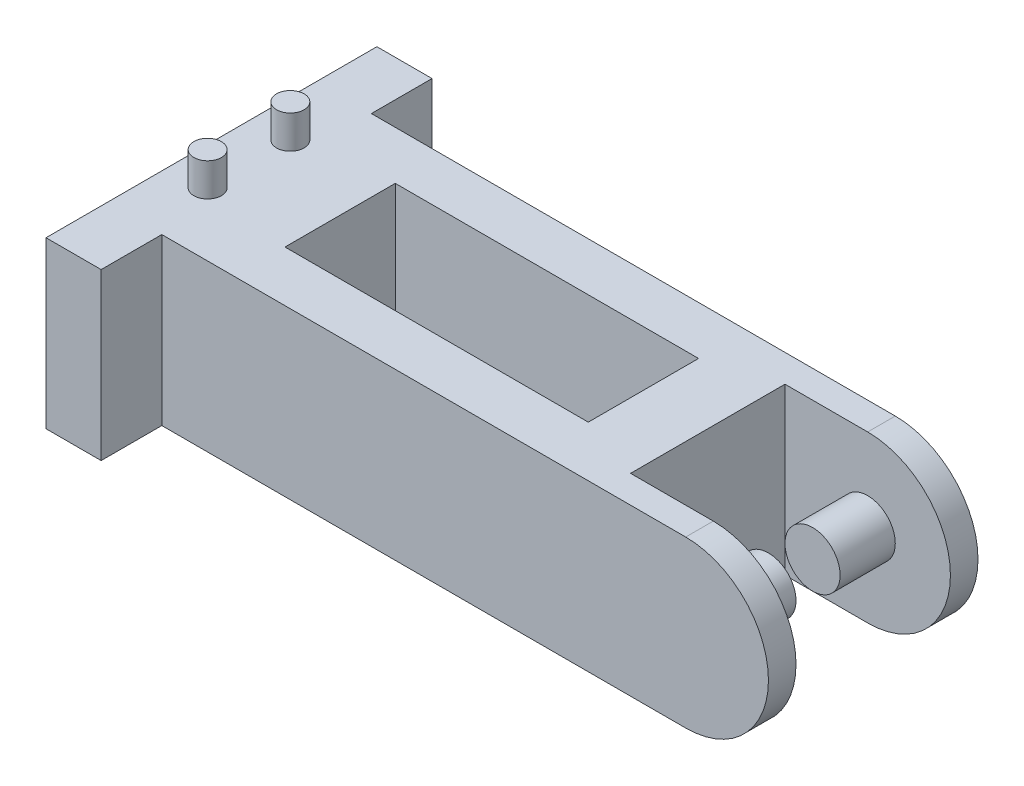
ISO-10303-21;
HEADER;
FILE_DESCRIPTION(('STEP AP214'),'2;1');
FILE_NAME('part.step','',(''),(''),'','','');
FILE_SCHEMA(('AUTOMOTIVE_DESIGN { 1 0 10303 214 1 1 1 1 }'));
ENDSEC;
DATA;
#1=APPLICATION_CONTEXT('core data for automotive mechanical design processes');
#2=APPLICATION_PROTOCOL_DEFINITION('international standard','automotive_design',2000,#1);
#3=PRODUCT_CONTEXT('',#1,'mechanical');
#4=PRODUCT('Part','Part','',(#3));
#5=PRODUCT_RELATED_PRODUCT_CATEGORY('part','',(#4));
#6=PRODUCT_DEFINITION_FORMATION('','',#4);
#7=PRODUCT_DEFINITION_CONTEXT('part definition',#1,'design');
#8=PRODUCT_DEFINITION('design','',#6,#7);
#9=PRODUCT_DEFINITION_SHAPE('','',#8);
#10=(LENGTH_UNIT() NAMED_UNIT(*) SI_UNIT(.MILLI.,.METRE.));
#11=(NAMED_UNIT(*) PLANE_ANGLE_UNIT() SI_UNIT($,.RADIAN.));
#12=(NAMED_UNIT(*) SI_UNIT($,.STERADIAN.) SOLID_ANGLE_UNIT());
#13=UNCERTAINTY_MEASURE_WITH_UNIT(LENGTH_MEASURE(1.E-05),#10,'distance_accuracy_value','');
#14=(GEOMETRIC_REPRESENTATION_CONTEXT(3) GLOBAL_UNCERTAINTY_ASSIGNED_CONTEXT((#13)) GLOBAL_UNIT_ASSIGNED_CONTEXT((#10,
#11,#12)) REPRESENTATION_CONTEXT('',''));
#15=CARTESIAN_POINT('',(0.,0.,0.));
#16=DIRECTION('',(0.,0.,1.));
#17=DIRECTION('',(1.,0.,0.));
#18=AXIS2_PLACEMENT_3D('',#15,#16,#17);
#19=CARTESIAN_POINT('',(-13.1249745176709,-15.,-19.));
#20=DIRECTION('',(0.,0.,-1.));
#21=DIRECTION('',(-1.,0.,0.));
#22=AXIS2_PLACEMENT_3D('',#19,#20,#21);
#23=PLANE('',#22);
#24=CARTESIAN_POINT('',(81.8750254823291,0.,-19.));
#25=DIRECTION('',(0.,0.,1.));
#26=DIRECTION('',(1.,0.,0.));
#27=AXIS2_PLACEMENT_3D('',#24,#25,#26);
#28=CIRCLE('',#27,15.);
#29=CARTESIAN_POINT('',(81.8750254823291,-15.,-19.));
#30=VERTEX_POINT('',#29);
#31=CARTESIAN_POINT('',(81.8750254823291,15.,-19.));
#32=VERTEX_POINT('',#31);
#33=EDGE_CURVE('E192',#30,#32,#28,.T.);
#34=ORIENTED_EDGE('',*,*,#33,.F.);
#35=DIRECTION('',(-1.,0.,0.));
#36=VECTOR('',#35,1.);
#37=CARTESIAN_POINT('',(-13.1249745176709,-15.,-19.));
#38=LINE('',#37,#36);
#39=CARTESIAN_POINT('',(-13.1249745176709,-15.,-19.));
#40=VERTEX_POINT('',#39);
#41=EDGE_CURVE('E231',#30,#40,#38,.T.);
#42=ORIENTED_EDGE('',*,*,#41,.T.);
#43=DIRECTION('',(0.,1.,0.));
#44=VECTOR('',#43,1.);
#45=CARTESIAN_POINT('',(-13.1249745176709,-15.,-19.));
#46=LINE('',#45,#44);
#47=CARTESIAN_POINT('',(-13.1249745176709,15.,-19.));
#48=VERTEX_POINT('',#47);
#49=EDGE_CURVE('E259',#40,#48,#46,.T.);
#50=ORIENTED_EDGE('',*,*,#49,.T.);
#51=DIRECTION('',(-1.,0.,0.));
#52=VECTOR('',#51,1.);
#53=CARTESIAN_POINT('',(-13.1249745176709,15.,-19.));
#54=LINE('',#53,#52);
#55=EDGE_CURVE('E203',#32,#48,#54,.T.);
#56=ORIENTED_EDGE('',*,*,#55,.F.);
#57=EDGE_LOOP('',(#34,#42,#50,#56));
#58=FACE_BOUND('',#57,.T.);
#59=ADVANCED_FACE('F41',(#58),#23,.T.);
#60=CARTESIAN_POINT('',(96.8750254823291,-15.,-14.));
#61=DIRECTION('',(0.,0.,1.));
#62=DIRECTION('',(1.,0.,0.));
#63=AXIS2_PLACEMENT_3D('',#60,#61,#62);
#64=PLANE('',#63);
#65=CARTESIAN_POINT('',(81.8750254823291,0.,-14.));
#66=DIRECTION('',(0.,0.,1.));
#67=DIRECTION('',(1.,0.,0.));
#68=AXIS2_PLACEMENT_3D('',#65,#66,#67);
#69=CIRCLE('',#68,5.);
#70=CARTESIAN_POINT('',(86.8750254823291,0.,-14.));
#71=VERTEX_POINT('',#70);
#72=EDGE_CURVE('E282',#71,#71,#69,.T.);
#73=ORIENTED_EDGE('',*,*,#72,.F.);
#74=EDGE_LOOP('',(#73));
#75=FACE_BOUND('',#74,.T.);
#76=DIRECTION('',(1.,0.,0.));
#77=VECTOR('',#76,1.);
#78=CARTESIAN_POINT('',(96.8750254823291,-15.,-14.));
#79=LINE('',#78,#77);
#80=CARTESIAN_POINT('',(66.8750254823291,-15.,-14.));
#81=VERTEX_POINT('',#80);
#82=CARTESIAN_POINT('',(81.8750254823291,-15.,-14.));
#83=VERTEX_POINT('',#82);
#84=EDGE_CURVE('E256',#81,#83,#79,.T.);
#85=ORIENTED_EDGE('',*,*,#84,.T.);
#86=CARTESIAN_POINT('',(81.8750254823291,0.,-14.));
#87=DIRECTION('',(0.,0.,1.));
#88=DIRECTION('',(1.,0.,0.));
#89=AXIS2_PLACEMENT_3D('',#86,#87,#88);
#90=CIRCLE('',#89,15.);
#91=CARTESIAN_POINT('',(81.8750254823291,15.,-14.));
#92=VERTEX_POINT('',#91);
#93=EDGE_CURVE('E200',#83,#92,#90,.T.);
#94=ORIENTED_EDGE('',*,*,#93,.T.);
#95=DIRECTION('',(1.,0.,0.));
#96=VECTOR('',#95,1.);
#97=CARTESIAN_POINT('',(96.8750254823291,15.,-14.));
#98=LINE('',#97,#96);
#99=CARTESIAN_POINT('',(66.8750254823291,15.,-14.));
#100=VERTEX_POINT('',#99);
#101=EDGE_CURVE('E228',#100,#92,#98,.T.);
#102=ORIENTED_EDGE('',*,*,#101,.F.);
#103=DIRECTION('',(0.,1.,0.));
#104=VECTOR('',#103,1.);
#105=CARTESIAN_POINT('',(66.8750254823291,-15.,-14.));
#106=LINE('',#105,#104);
#107=EDGE_CURVE('E260',#81,#100,#106,.T.);
#108=ORIENTED_EDGE('',*,*,#107,.F.);
#109=EDGE_LOOP('',(#85,#94,#102,#108));
#110=FACE_BOUND('',#109,.T.);
#111=ADVANCED_FACE('F307',(#75,#110),#64,.T.);
#112=CARTESIAN_POINT('',(96.8750254823291,-15.,14.));
#113=DIRECTION('',(0.,0.,-1.));
#114=DIRECTION('',(-1.,0.,0.));
#115=AXIS2_PLACEMENT_3D('',#112,#113,#114);
#116=PLANE('',#115);
#117=CARTESIAN_POINT('',(81.8750254823291,0.,14.));
#118=DIRECTION('',(0.,0.,-1.));
#119=DIRECTION('',(-1.,0.,0.));
#120=AXIS2_PLACEMENT_3D('',#117,#118,#119);
#121=CIRCLE('',#120,5.);
#122=CARTESIAN_POINT('',(76.8750254823291,0.,14.));
#123=VERTEX_POINT('',#122);
#124=EDGE_CURVE('E437',#123,#123,#121,.T.);
#125=ORIENTED_EDGE('',*,*,#124,.F.);
#126=EDGE_LOOP('',(#125));
#127=FACE_BOUND('',#126,.T.);
#128=CARTESIAN_POINT('',(81.8750254823291,0.,14.));
#129=DIRECTION('',(0.,0.,-1.));
#130=DIRECTION('',(-1.,0.,0.));
#131=AXIS2_PLACEMENT_3D('',#128,#129,#130);
#132=CIRCLE('',#131,15.);
#133=CARTESIAN_POINT('',(81.8750254823291,15.,14.));
#134=VERTEX_POINT('',#133);
#135=CARTESIAN_POINT('',(81.8750254823291,-15.,14.));
#136=VERTEX_POINT('',#135);
#137=EDGE_CURVE('E198',#134,#136,#132,.T.);
#138=ORIENTED_EDGE('',*,*,#137,.T.);
#139=DIRECTION('',(-1.,0.,0.));
#140=VECTOR('',#139,1.);
#141=CARTESIAN_POINT('',(96.8750254823291,-15.,14.));
#142=LINE('',#141,#140);
#143=CARTESIAN_POINT('',(66.8750254823291,-15.,14.));
#144=VERTEX_POINT('',#143);
#145=EDGE_CURVE('E251',#136,#144,#142,.T.);
#146=ORIENTED_EDGE('',*,*,#145,.T.);
#147=DIRECTION('',(0.,1.,0.));
#148=VECTOR('',#147,1.);
#149=CARTESIAN_POINT('',(66.8750254823291,-15.,14.));
#150=LINE('',#149,#148);
#151=CARTESIAN_POINT('',(66.8750254823291,15.,14.));
#152=VERTEX_POINT('',#151);
#153=EDGE_CURVE('E263',#144,#152,#150,.T.);
#154=ORIENTED_EDGE('',*,*,#153,.T.);
#155=DIRECTION('',(-1.,0.,0.));
#156=VECTOR('',#155,1.);
#157=CARTESIAN_POINT('',(96.8750254823291,15.,14.));
#158=LINE('',#157,#156);
#159=EDGE_CURVE('E223',#134,#152,#158,.T.);
#160=ORIENTED_EDGE('',*,*,#159,.F.);
#161=EDGE_LOOP('',(#138,#146,#154,#160));
#162=FACE_BOUND('',#161,.T.);
#163=ADVANCED_FACE('F312',(#127,#162),#116,.T.);
#164=CARTESIAN_POINT('',(-13.1249745176709,-15.,19.));
#165=DIRECTION('',(0.,0.,1.));
#166=DIRECTION('',(1.,0.,0.));
#167=AXIS2_PLACEMENT_3D('',#164,#165,#166);
#168=PLANE('',#167);
#169=DIRECTION('',(1.,0.,0.));
#170=VECTOR('',#169,1.);
#171=CARTESIAN_POINT('',(-13.1249745176709,-15.,19.));
#172=LINE('',#171,#170);
#173=CARTESIAN_POINT('',(-13.1249745176709,-15.,19.));
#174=VERTEX_POINT('',#173);
#175=CARTESIAN_POINT('',(81.8750254823291,-15.,19.));
#176=VERTEX_POINT('',#175);
#177=EDGE_CURVE('E248',#174,#176,#172,.T.);
#178=ORIENTED_EDGE('',*,*,#177,.T.);
#179=CARTESIAN_POINT('',(81.8750254823291,0.,19.));
#180=DIRECTION('',(0.,0.,1.));
#181=DIRECTION('',(1.,0.,0.));
#182=AXIS2_PLACEMENT_3D('',#179,#180,#181);
#183=CIRCLE('',#182,15.);
#184=CARTESIAN_POINT('',(81.8750254823291,15.,19.));
#185=VERTEX_POINT('',#184);
#186=EDGE_CURVE('E191',#176,#185,#183,.T.);
#187=ORIENTED_EDGE('',*,*,#186,.T.);
#188=DIRECTION('',(1.,0.,0.));
#189=VECTOR('',#188,1.);
#190=CARTESIAN_POINT('',(-13.1249745176709,15.,19.));
#191=LINE('',#190,#189);
#192=CARTESIAN_POINT('',(-13.1249745176709,15.,19.));
#193=VERTEX_POINT('',#192);
#194=EDGE_CURVE('E220',#193,#185,#191,.T.);
#195=ORIENTED_EDGE('',*,*,#194,.F.);
#196=DIRECTION('',(0.,1.,0.));
#197=VECTOR('',#196,1.);
#198=CARTESIAN_POINT('',(-13.1249745176709,-15.,19.));
#199=LINE('',#198,#197);
#200=EDGE_CURVE('E266',#174,#193,#199,.T.);
#201=ORIENTED_EDGE('',*,*,#200,.F.);
#202=EDGE_LOOP('',(#178,#187,#195,#201));
#203=FACE_BOUND('',#202,.T.);
#204=ADVANCED_FACE('F301',(#203),#168,.T.);
#205=CARTESIAN_POINT('',(0.,-15.,0.));
#206=DIRECTION('',(0.,-1.,0.));
#207=DIRECTION('',(0.,0.,-1.));
#208=AXIS2_PLACEMENT_3D('',#205,#206,#207);
#209=PLANE('',#208);
#210=DIRECTION('',(0.,0.,-1.));
#211=VECTOR('',#210,1.);
#212=CARTESIAN_POINT('',(0.,-15.,0.));
#213=LINE('',#212,#211);
#214=CARTESIAN_POINT('',(0.,-15.,9.79402466344234));
#215=VERTEX_POINT('',#214);
#216=CARTESIAN_POINT('',(0.,-15.,-10.2059753365577));
#217=VERTEX_POINT('',#216);
#218=EDGE_CURVE('E186',#215,#217,#213,.T.);
#219=ORIENTED_EDGE('',*,*,#218,.F.);
#220=DIRECTION('',(-1.,0.,0.));
#221=VECTOR('',#220,1.);
#222=CARTESIAN_POINT('',(0.,-15.,9.79402466344234));
#223=LINE('',#222,#221);
#224=CARTESIAN_POINT('',(55.,-15.,9.79402466344234));
#225=VERTEX_POINT('',#224);
#226=EDGE_CURVE('E179',#225,#215,#223,.T.);
#227=ORIENTED_EDGE('',*,*,#226,.F.);
#228=DIRECTION('',(0.,0.,1.));
#229=VECTOR('',#228,1.);
#230=CARTESIAN_POINT('',(55.,-15.,0.));
#231=LINE('',#230,#229);
#232=CARTESIAN_POINT('',(55.,-15.,-10.2059753365577));
#233=VERTEX_POINT('',#232);
#234=EDGE_CURVE('E159',#233,#225,#231,.T.);
#235=ORIENTED_EDGE('',*,*,#234,.F.);
#236=DIRECTION('',(1.,0.,0.));
#237=VECTOR('',#236,1.);
#238=CARTESIAN_POINT('',(0.,-15.,-10.2059753365577));
#239=LINE('',#238,#237);
#240=EDGE_CURVE('E184',#217,#233,#239,.T.);
#241=ORIENTED_EDGE('',*,*,#240,.F.);
#242=EDGE_LOOP('',(#219,#227,#235,#241));
#243=FACE_BOUND('',#242,.T.);
#244=ORIENTED_EDGE('',*,*,#41,.F.);
#245=DIRECTION('',(0.,0.,1.));
#246=VECTOR('',#245,1.);
#247=CARTESIAN_POINT('',(81.8750254823291,-15.,-19.));
#248=LINE('',#247,#246);
#249=EDGE_CURVE('E188',#30,#83,#248,.T.);
#250=ORIENTED_EDGE('',*,*,#249,.T.);
#251=ORIENTED_EDGE('',*,*,#84,.F.);
#252=DIRECTION('',(0.,0.,-1.));
#253=VECTOR('',#252,1.);
#254=CARTESIAN_POINT('',(66.8750254823291,-15.,-14.));
#255=LINE('',#254,#253);
#256=EDGE_CURVE('E253',#144,#81,#255,.T.);
#257=ORIENTED_EDGE('',*,*,#256,.F.);
#258=ORIENTED_EDGE('',*,*,#145,.F.);
#259=DIRECTION('',(0.,0.,1.));
#260=VECTOR('',#259,1.);
#261=CARTESIAN_POINT('',(81.8750254823291,-15.,-19.));
#262=LINE('',#261,#260);
#263=EDGE_CURVE('E279',#136,#176,#262,.T.);
#264=ORIENTED_EDGE('',*,*,#263,.T.);
#265=ORIENTED_EDGE('',*,*,#177,.F.);
#266=DIRECTION('',(0.,0.,-1.));
#267=VECTOR('',#266,1.);
#268=CARTESIAN_POINT('',(-13.1249745176709,-15.,30.));
#269=LINE('',#268,#267);
#270=CARTESIAN_POINT('',(-13.1249745176709,-15.,30.));
#271=VERTEX_POINT('',#270);
#272=EDGE_CURVE('E245',#271,#174,#269,.T.);
#273=ORIENTED_EDGE('',*,*,#272,.F.);
#274=DIRECTION('',(1.,0.,0.));
#275=VECTOR('',#274,1.);
#276=CARTESIAN_POINT('',(-23.1249745176709,-15.,30.));
#277=LINE('',#276,#275);
#278=CARTESIAN_POINT('',(-23.1249745176709,-15.,30.));
#279=VERTEX_POINT('',#278);
#280=EDGE_CURVE('E242',#279,#271,#277,.T.);
#281=ORIENTED_EDGE('',*,*,#280,.F.);
#282=DIRECTION('',(0.,0.,1.));
#283=VECTOR('',#282,1.);
#284=CARTESIAN_POINT('',(-23.1249745176709,-15.,-30.));
#285=LINE('',#284,#283);
#286=CARTESIAN_POINT('',(-23.1249745176709,-15.,-30.));
#287=VERTEX_POINT('',#286);
#288=EDGE_CURVE('E239',#287,#279,#285,.T.);
#289=ORIENTED_EDGE('',*,*,#288,.F.);
#290=DIRECTION('',(-1.,0.,0.));
#291=VECTOR('',#290,1.);
#292=CARTESIAN_POINT('',(-23.1249745176709,-15.,-30.));
#293=LINE('',#292,#291);
#294=CARTESIAN_POINT('',(-13.1249745176709,-15.,-30.));
#295=VERTEX_POINT('',#294);
#296=EDGE_CURVE('E236',#295,#287,#293,.T.);
#297=ORIENTED_EDGE('',*,*,#296,.F.);
#298=DIRECTION('',(0.,0.,-1.));
#299=VECTOR('',#298,1.);
#300=CARTESIAN_POINT('',(-13.1249745176709,-15.,-30.));
#301=LINE('',#300,#299);
#302=EDGE_CURVE('E233',#40,#295,#301,.T.);
#303=ORIENTED_EDGE('',*,*,#302,.F.);
#304=EDGE_LOOP('',(#244,#250,#251,#257,#258,#264,#265,#273,#281,#289,#297,#303));
#305=FACE_BOUND('',#304,.T.);
#306=ADVANCED_FACE('F291',(#243,#305),#209,.T.);
#307=CARTESIAN_POINT('',(0.,15.,0.));
#308=DIRECTION('',(0.,-1.,0.));
#309=DIRECTION('',(0.,0.,-1.));
#310=AXIS2_PLACEMENT_3D('',#307,#308,#309);
#311=PLANE('',#310);
#312=CARTESIAN_POINT('',(-16.3207922027181,15.,7.5));
#313=DIRECTION('',(0.,-1.,0.));
#314=DIRECTION('',(0.,0.,-1.));
#315=AXIS2_PLACEMENT_3D('',#312,#313,#314);
#316=CIRCLE('',#315,2.5);
#317=CARTESIAN_POINT('',(-16.3207922027181,15.,5.));
#318=VERTEX_POINT('',#317);
#319=EDGE_CURVE('E11',#318,#318,#316,.F.);
#320=ORIENTED_EDGE('',*,*,#319,.F.);
#321=EDGE_LOOP('',(#320));
#322=FACE_BOUND('',#321,.T.);
#323=CARTESIAN_POINT('',(-16.3207922027181,15.,-7.5));
#324=DIRECTION('',(0.,-1.,0.));
#325=DIRECTION('',(0.,0.,-1.));
#326=AXIS2_PLACEMENT_3D('',#323,#324,#325);
#327=CIRCLE('',#326,2.5);
#328=CARTESIAN_POINT('',(-16.3207922027181,15.,-10.));
#329=VERTEX_POINT('',#328);
#330=EDGE_CURVE('E48',#329,#329,#327,.F.);
#331=ORIENTED_EDGE('',*,*,#330,.F.);
#332=EDGE_LOOP('',(#331));
#333=FACE_BOUND('',#332,.T.);
#334=DIRECTION('',(1.,0.,0.));
#335=VECTOR('',#334,1.);
#336=CARTESIAN_POINT('',(0.,15.,9.79402466344234));
#337=LINE('',#336,#335);
#338=CARTESIAN_POINT('',(0.,15.,9.79402466344234));
#339=VERTEX_POINT('',#338);
#340=CARTESIAN_POINT('',(55.,15.,9.79402466344234));
#341=VERTEX_POINT('',#340);
#342=EDGE_CURVE('E165',#339,#341,#337,.T.);
#343=ORIENTED_EDGE('',*,*,#342,.F.);
#344=DIRECTION('',(0.,0.,1.));
#345=VECTOR('',#344,1.);
#346=CARTESIAN_POINT('',(0.,15.,-10.2059753365577));
#347=LINE('',#346,#345);
#348=CARTESIAN_POINT('',(0.,15.,-10.2059753365577));
#349=VERTEX_POINT('',#348);
#350=EDGE_CURVE('E63',#349,#339,#347,.T.);
#351=ORIENTED_EDGE('',*,*,#350,.F.);
#352=DIRECTION('',(-1.,0.,0.));
#353=VECTOR('',#352,1.);
#354=CARTESIAN_POINT('',(0.,15.,-10.2059753365577));
#355=LINE('',#354,#353);
#356=CARTESIAN_POINT('',(55.,15.,-10.2059753365577));
#357=VERTEX_POINT('',#356);
#358=EDGE_CURVE('E172',#357,#349,#355,.T.);
#359=ORIENTED_EDGE('',*,*,#358,.F.);
#360=DIRECTION('',(0.,0.,-1.));
#361=VECTOR('',#360,1.);
#362=CARTESIAN_POINT('',(55.,15.,-10.2059753365577));
#363=LINE('',#362,#361);
#364=EDGE_CURVE('E156',#341,#357,#363,.T.);
#365=ORIENTED_EDGE('',*,*,#364,.F.);
#366=EDGE_LOOP('',(#343,#351,#359,#365));
#367=FACE_BOUND('',#366,.T.);
#368=DIRECTION('',(0.,0.,1.));
#369=VECTOR('',#368,1.);
#370=CARTESIAN_POINT('',(81.8750254823291,15.,-19.));
#371=LINE('',#370,#369);
#372=EDGE_CURVE('E194',#32,#92,#371,.T.);
#373=ORIENTED_EDGE('',*,*,#372,.F.);
#374=ORIENTED_EDGE('',*,*,#55,.T.);
#375=DIRECTION('',(0.,0.,-1.));
#376=VECTOR('',#375,1.);
#377=CARTESIAN_POINT('',(-13.1249745176709,15.,-30.));
#378=LINE('',#377,#376);
#379=CARTESIAN_POINT('',(-13.1249745176709,15.,-30.));
#380=VERTEX_POINT('',#379);
#381=EDGE_CURVE('E205',#48,#380,#378,.T.);
#382=ORIENTED_EDGE('',*,*,#381,.T.);
#383=DIRECTION('',(-1.,0.,0.));
#384=VECTOR('',#383,1.);
#385=CARTESIAN_POINT('',(-23.1249745176709,15.,-30.));
#386=LINE('',#385,#384);
#387=CARTESIAN_POINT('',(-23.1249745176709,15.,-30.));
#388=VERTEX_POINT('',#387);
#389=EDGE_CURVE('E208',#380,#388,#386,.T.);
#390=ORIENTED_EDGE('',*,*,#389,.T.);
#391=DIRECTION('',(0.,0.,1.));
#392=VECTOR('',#391,1.);
#393=CARTESIAN_POINT('',(-23.1249745176709,15.,-30.));
#394=LINE('',#393,#392);
#395=CARTESIAN_POINT('',(-23.1249745176709,15.,30.));
#396=VERTEX_POINT('',#395);
#397=EDGE_CURVE('E211',#388,#396,#394,.T.);
#398=ORIENTED_EDGE('',*,*,#397,.T.);
#399=DIRECTION('',(1.,0.,0.));
#400=VECTOR('',#399,1.);
#401=CARTESIAN_POINT('',(-23.1249745176709,15.,30.));
#402=LINE('',#401,#400);
#403=CARTESIAN_POINT('',(-13.1249745176709,15.,30.));
#404=VERTEX_POINT('',#403);
#405=EDGE_CURVE('E214',#396,#404,#402,.T.);
#406=ORIENTED_EDGE('',*,*,#405,.T.);
#407=DIRECTION('',(0.,0.,-1.));
#408=VECTOR('',#407,1.);
#409=CARTESIAN_POINT('',(-13.1249745176709,15.,30.));
#410=LINE('',#409,#408);
#411=EDGE_CURVE('E217',#404,#193,#410,.T.);
#412=ORIENTED_EDGE('',*,*,#411,.T.);
#413=ORIENTED_EDGE('',*,*,#194,.T.);
#414=DIRECTION('',(0.,0.,1.));
#415=VECTOR('',#414,1.);
#416=CARTESIAN_POINT('',(81.8750254823291,15.,-19.));
#417=LINE('',#416,#415);
#418=EDGE_CURVE('E262',#134,#185,#417,.T.);
#419=ORIENTED_EDGE('',*,*,#418,.F.);
#420=ORIENTED_EDGE('',*,*,#159,.T.);
#421=DIRECTION('',(0.,0.,-1.));
#422=VECTOR('',#421,1.);
#423=CARTESIAN_POINT('',(66.8750254823291,15.,-14.));
#424=LINE('',#423,#422);
#425=EDGE_CURVE('E225',#152,#100,#424,.T.);
#426=ORIENTED_EDGE('',*,*,#425,.T.);
#427=ORIENTED_EDGE('',*,*,#101,.T.);
#428=EDGE_LOOP('',(#373,#374,#382,#390,#398,#406,#412,#413,#419,#420,#426,#427));
#429=FACE_BOUND('',#428,.T.);
#430=ADVANCED_FACE('F169',(#322,#333,#367,#429),#311,.F.);
#431=CARTESIAN_POINT('',(66.8750254823291,-15.,-14.));
#432=DIRECTION('',(1.,0.,0.));
#433=DIRECTION('',(0.,0.,-1.));
#434=AXIS2_PLACEMENT_3D('',#431,#432,#433);
#435=PLANE('',#434);
#436=ORIENTED_EDGE('',*,*,#107,.T.);
#437=ORIENTED_EDGE('',*,*,#425,.F.);
#438=ORIENTED_EDGE('',*,*,#153,.F.);
#439=ORIENTED_EDGE('',*,*,#256,.T.);
#440=EDGE_LOOP('',(#436,#437,#438,#439));
#441=FACE_BOUND('',#440,.T.);
#442=ADVANCED_FACE('F290',(#441),#435,.T.);
#443=CARTESIAN_POINT('',(-13.1249745176709,-15.,30.));
#444=DIRECTION('',(1.,0.,0.));
#445=DIRECTION('',(0.,0.,-1.));
#446=AXIS2_PLACEMENT_3D('',#443,#444,#445);
#447=PLANE('',#446);
#448=ORIENTED_EDGE('',*,*,#200,.T.);
#449=ORIENTED_EDGE('',*,*,#411,.F.);
#450=DIRECTION('',(0.,1.,0.));
#451=VECTOR('',#450,1.);
#452=CARTESIAN_POINT('',(-13.1249745176709,-15.,30.));
#453=LINE('',#452,#451);
#454=EDGE_CURVE('E268',#271,#404,#453,.T.);
#455=ORIENTED_EDGE('',*,*,#454,.F.);
#456=ORIENTED_EDGE('',*,*,#272,.T.);
#457=EDGE_LOOP('',(#448,#449,#455,#456));
#458=FACE_BOUND('',#457,.T.);
#459=ADVANCED_FACE('F298',(#458),#447,.T.);
#460=CARTESIAN_POINT('',(-23.1249745176709,-15.,30.));
#461=DIRECTION('',(0.,0.,1.));
#462=DIRECTION('',(1.,0.,0.));
#463=AXIS2_PLACEMENT_3D('',#460,#461,#462);
#464=PLANE('',#463);
#465=ORIENTED_EDGE('',*,*,#454,.T.);
#466=ORIENTED_EDGE('',*,*,#405,.F.);
#467=DIRECTION('',(0.,1.,0.));
#468=VECTOR('',#467,1.);
#469=CARTESIAN_POINT('',(-23.1249745176709,-15.,30.));
#470=LINE('',#469,#468);
#471=EDGE_CURVE('E270',#279,#396,#470,.T.);
#472=ORIENTED_EDGE('',*,*,#471,.F.);
#473=ORIENTED_EDGE('',*,*,#280,.T.);
#474=EDGE_LOOP('',(#465,#466,#472,#473));
#475=FACE_BOUND('',#474,.T.);
#476=ADVANCED_FACE('F340',(#475),#464,.T.);
#477=CARTESIAN_POINT('',(-23.1249745176709,-15.,-30.));
#478=DIRECTION('',(-1.,0.,0.));
#479=DIRECTION('',(0.,0.,1.));
#480=AXIS2_PLACEMENT_3D('',#477,#478,#479);
#481=PLANE('',#480);
#482=ORIENTED_EDGE('',*,*,#471,.T.);
#483=ORIENTED_EDGE('',*,*,#397,.F.);
#484=DIRECTION('',(0.,1.,0.));
#485=VECTOR('',#484,1.);
#486=CARTESIAN_POINT('',(-23.1249745176709,-15.,-30.));
#487=LINE('',#486,#485);
#488=EDGE_CURVE('E272',#287,#388,#487,.T.);
#489=ORIENTED_EDGE('',*,*,#488,.F.);
#490=ORIENTED_EDGE('',*,*,#288,.T.);
#491=EDGE_LOOP('',(#482,#483,#489,#490));
#492=FACE_BOUND('',#491,.T.);
#493=ADVANCED_FACE('F335',(#492),#481,.T.);
#494=CARTESIAN_POINT('',(-23.1249745176709,-15.,-30.));
#495=DIRECTION('',(0.,0.,-1.));
#496=DIRECTION('',(-1.,0.,0.));
#497=AXIS2_PLACEMENT_3D('',#494,#495,#496);
#498=PLANE('',#497);
#499=ORIENTED_EDGE('',*,*,#488,.T.);
#500=ORIENTED_EDGE('',*,*,#389,.F.);
#501=DIRECTION('',(0.,1.,0.));
#502=VECTOR('',#501,1.);
#503=CARTESIAN_POINT('',(-13.1249745176709,-15.,-30.));
#504=LINE('',#503,#502);
#505=EDGE_CURVE('E274',#295,#380,#504,.T.);
#506=ORIENTED_EDGE('',*,*,#505,.F.);
#507=ORIENTED_EDGE('',*,*,#296,.T.);
#508=EDGE_LOOP('',(#499,#500,#506,#507));
#509=FACE_BOUND('',#508,.T.);
#510=ADVANCED_FACE('F333',(#509),#498,.T.);
#511=CARTESIAN_POINT('',(-13.1249745176709,-15.,-30.));
#512=DIRECTION('',(1.,0.,0.));
#513=DIRECTION('',(0.,0.,-1.));
#514=AXIS2_PLACEMENT_3D('',#511,#512,#513);
#515=PLANE('',#514);
#516=ORIENTED_EDGE('',*,*,#505,.T.);
#517=ORIENTED_EDGE('',*,*,#381,.F.);
#518=ORIENTED_EDGE('',*,*,#49,.F.);
#519=ORIENTED_EDGE('',*,*,#302,.T.);
#520=EDGE_LOOP('',(#516,#517,#518,#519));
#521=FACE_BOUND('',#520,.T.);
#522=ADVANCED_FACE('F328',(#521),#515,.T.);
#523=CARTESIAN_POINT('',(81.8750254823291,0.,-19.));
#524=DIRECTION('',(0.,0.,1.));
#525=DIRECTION('',(1.,0.,0.));
#526=AXIS2_PLACEMENT_3D('',#523,#524,#525);
#527=CYLINDRICAL_SURFACE('',#526,15.);
#528=ORIENTED_EDGE('',*,*,#418,.T.);
#529=ORIENTED_EDGE('',*,*,#186,.F.);
#530=ORIENTED_EDGE('',*,*,#263,.F.);
#531=ORIENTED_EDGE('',*,*,#137,.F.);
#532=EDGE_LOOP('',(#528,#529,#530,#531));
#533=FACE_BOUND('',#532,.T.);
#534=ADVANCED_FACE('F350',(#533),#527,.T.);
#535=ORIENTED_EDGE('',*,*,#93,.F.);
#536=ORIENTED_EDGE('',*,*,#249,.F.);
#537=ORIENTED_EDGE('',*,*,#33,.T.);
#538=ORIENTED_EDGE('',*,*,#372,.T.);
#539=EDGE_LOOP('',(#535,#536,#537,#538));
#540=FACE_BOUND('',#539,.T.);
#541=ADVANCED_FACE('F321',(#540),#527,.T.);
#542=CARTESIAN_POINT('',(0.,-23.,-10.2059753365577));
#543=DIRECTION('',(-1.,0.,0.));
#544=DIRECTION('',(0.,0.,1.));
#545=AXIS2_PLACEMENT_3D('',#542,#543,#544);
#546=PLANE('',#545);
#547=ORIENTED_EDGE('',*,*,#218,.T.);
#548=DIRECTION('',(0.,1.,0.));
#549=VECTOR('',#548,1.);
#550=CARTESIAN_POINT('',(0.,-23.,-10.2059753365577));
#551=LINE('',#550,#549);
#552=EDGE_CURVE('E177',#217,#349,#551,.T.);
#553=ORIENTED_EDGE('',*,*,#552,.T.);
#554=ORIENTED_EDGE('',*,*,#350,.T.);
#555=DIRECTION('',(0.,1.,0.));
#556=VECTOR('',#555,1.);
#557=CARTESIAN_POINT('',(0.,-23.,9.79402466344234));
#558=LINE('',#557,#556);
#559=EDGE_CURVE('E162',#215,#339,#558,.T.);
#560=ORIENTED_EDGE('',*,*,#559,.F.);
#561=EDGE_LOOP('',(#547,#553,#554,#560));
#562=FACE_BOUND('',#561,.T.);
#563=ADVANCED_FACE('F381',(#562),#546,.F.);
#564=CARTESIAN_POINT('',(0.,-23.,-10.2059753365577));
#565=DIRECTION('',(0.,0.,-1.));
#566=DIRECTION('',(-1.,0.,0.));
#567=AXIS2_PLACEMENT_3D('',#564,#565,#566);
#568=PLANE('',#567);
#569=ORIENTED_EDGE('',*,*,#240,.T.);
#570=DIRECTION('',(0.,1.,0.));
#571=VECTOR('',#570,1.);
#572=CARTESIAN_POINT('',(55.,-23.,-10.2059753365577));
#573=LINE('',#572,#571);
#574=EDGE_CURVE('E161',#233,#357,#573,.T.);
#575=ORIENTED_EDGE('',*,*,#574,.T.);
#576=ORIENTED_EDGE('',*,*,#358,.T.);
#577=ORIENTED_EDGE('',*,*,#552,.F.);
#578=EDGE_LOOP('',(#569,#575,#576,#577));
#579=FACE_BOUND('',#578,.T.);
#580=ADVANCED_FACE('F385',(#579),#568,.F.);
#581=CARTESIAN_POINT('',(55.,-23.,-10.2059753365577));
#582=DIRECTION('',(1.,0.,0.));
#583=DIRECTION('',(0.,0.,-1.));
#584=AXIS2_PLACEMENT_3D('',#581,#582,#583);
#585=PLANE('',#584);
#586=ORIENTED_EDGE('',*,*,#234,.T.);
#587=DIRECTION('',(0.,1.,0.));
#588=VECTOR('',#587,1.);
#589=CARTESIAN_POINT('',(55.,-23.,9.79402466344234));
#590=LINE('',#589,#588);
#591=EDGE_CURVE('E55',#225,#341,#590,.T.);
#592=ORIENTED_EDGE('',*,*,#591,.T.);
#593=ORIENTED_EDGE('',*,*,#364,.T.);
#594=ORIENTED_EDGE('',*,*,#574,.F.);
#595=EDGE_LOOP('',(#586,#592,#593,#594));
#596=FACE_BOUND('',#595,.T.);
#597=ADVANCED_FACE('F153',(#596),#585,.F.);
#598=CARTESIAN_POINT('',(0.,-23.,9.79402466344234));
#599=DIRECTION('',(0.,0.,1.));
#600=DIRECTION('',(1.,0.,0.));
#601=AXIS2_PLACEMENT_3D('',#598,#599,#600);
#602=PLANE('',#601);
#603=ORIENTED_EDGE('',*,*,#226,.T.);
#604=ORIENTED_EDGE('',*,*,#559,.T.);
#605=ORIENTED_EDGE('',*,*,#342,.T.);
#606=ORIENTED_EDGE('',*,*,#591,.F.);
#607=EDGE_LOOP('',(#603,#604,#605,#606));
#608=FACE_BOUND('',#607,.T.);
#609=ADVANCED_FACE('F166',(#608),#602,.F.);
#610=CARTESIAN_POINT('',(81.8750254823291,0.,4.));
#611=DIRECTION('',(0.,0.,1.));
#612=DIRECTION('',(1.,0.,0.));
#613=AXIS2_PLACEMENT_3D('',#610,#611,#612);
#614=CYLINDRICAL_SURFACE('',#613,5.);
#615=CARTESIAN_POINT('',(81.8750254823291,0.,4.));
#616=DIRECTION('',(0.,0.,-1.));
#617=DIRECTION('',(-1.,0.,0.));
#618=AXIS2_PLACEMENT_3D('',#615,#616,#617);
#619=CIRCLE('',#618,5.);
#620=CARTESIAN_POINT('',(76.8750254823291,0.,4.));
#621=VERTEX_POINT('',#620);
#622=EDGE_CURVE('E438',#621,#621,#619,.T.);
#623=ORIENTED_EDGE('',*,*,#622,.F.);
#624=EDGE_LOOP('',(#623));
#625=FACE_BOUND('',#624,.T.);
#626=ORIENTED_EDGE('',*,*,#124,.T.);
#627=EDGE_LOOP('',(#626));
#628=FACE_BOUND('',#627,.T.);
#629=ADVANCED_FACE('F388',(#625,#628),#614,.T.);
#630=CARTESIAN_POINT('',(81.8750254823291,0.,4.));
#631=DIRECTION('',(0.,0.,-1.));
#632=DIRECTION('',(-1.,0.,0.));
#633=AXIS2_PLACEMENT_3D('',#630,#631,#632);
#634=PLANE('',#633);
#635=ORIENTED_EDGE('',*,*,#622,.T.);
#636=EDGE_LOOP('',(#635));
#637=FACE_BOUND('',#636,.T.);
#638=ADVANCED_FACE('F396',(#637),#634,.T.);
#639=CARTESIAN_POINT('',(81.8750254823291,0.,-4.));
#640=DIRECTION('',(0.,0.,-1.));
#641=DIRECTION('',(-1.,0.,0.));
#642=AXIS2_PLACEMENT_3D('',#639,#640,#641);
#643=CYLINDRICAL_SURFACE('',#642,5.);
#644=CARTESIAN_POINT('',(81.8750254823291,0.,-4.));
#645=DIRECTION('',(0.,0.,-1.));
#646=DIRECTION('',(-1.,0.,0.));
#647=AXIS2_PLACEMENT_3D('',#644,#645,#646);
#648=CIRCLE('',#647,5.);
#649=CARTESIAN_POINT('',(76.8750254823291,0.,-4.));
#650=VERTEX_POINT('',#649);
#651=EDGE_CURVE('E432',#650,#650,#648,.T.);
#652=ORIENTED_EDGE('',*,*,#651,.T.);
#653=EDGE_LOOP('',(#652));
#654=FACE_BOUND('',#653,.T.);
#655=ORIENTED_EDGE('',*,*,#72,.T.);
#656=EDGE_LOOP('',(#655));
#657=FACE_BOUND('',#656,.T.);
#658=ADVANCED_FACE('F400',(#654,#657),#643,.T.);
#659=CARTESIAN_POINT('',(81.8750254823291,0.,-4.));
#660=DIRECTION('',(0.,0.,1.));
#661=DIRECTION('',(-1.,0.,0.));
#662=AXIS2_PLACEMENT_3D('',#659,#660,#661);
#663=PLANE('',#662);
#664=ORIENTED_EDGE('',*,*,#651,.F.);
#665=EDGE_LOOP('',(#664));
#666=FACE_BOUND('',#665,.T.);
#667=ADVANCED_FACE('F404',(#666),#663,.T.);
#668=CARTESIAN_POINT('',(-16.3207922027181,21.,-7.5));
#669=DIRECTION('',(0.,-1.,0.));
#670=DIRECTION('',(0.,0.,-1.));
#671=AXIS2_PLACEMENT_3D('',#668,#669,#670);
#672=CYLINDRICAL_SURFACE('',#671,2.5);
#673=CARTESIAN_POINT('',(-16.3207922027181,21.,-7.5));
#674=DIRECTION('',(0.,1.,0.));
#675=DIRECTION('',(0.,0.,1.));
#676=AXIS2_PLACEMENT_3D('',#673,#674,#675);
#677=CIRCLE('',#676,2.5);
#678=CARTESIAN_POINT('',(-16.3207922027181,21.,-5.));
#679=VERTEX_POINT('',#678);
#680=EDGE_CURVE('E429',#679,#679,#677,.T.);
#681=ORIENTED_EDGE('',*,*,#680,.F.);
#682=EDGE_LOOP('',(#681));
#683=FACE_BOUND('',#682,.T.);
#684=ORIENTED_EDGE('',*,*,#330,.T.);
#685=EDGE_LOOP('',(#684));
#686=FACE_BOUND('',#685,.T.);
#687=ADVANCED_FACE('F287',(#683,#686),#672,.T.);
#688=CARTESIAN_POINT('',(-16.3207922027181,21.,-7.5));
#689=DIRECTION('',(0.,1.,0.));
#690=DIRECTION('',(0.,0.,1.));
#691=AXIS2_PLACEMENT_3D('',#688,#689,#690);
#692=PLANE('',#691);
#693=ORIENTED_EDGE('',*,*,#680,.T.);
#694=EDGE_LOOP('',(#693));
#695=FACE_BOUND('',#694,.T.);
#696=ADVANCED_FACE('F411',(#695),#692,.T.);
#697=CARTESIAN_POINT('',(-16.3207922027181,21.,7.5));
#698=DIRECTION('',(0.,-1.,0.));
#699=DIRECTION('',(0.,0.,-1.));
#700=AXIS2_PLACEMENT_3D('',#697,#698,#699);
#701=CYLINDRICAL_SURFACE('',#700,2.5);
#702=CARTESIAN_POINT('',(-16.3207922027181,21.,7.5));
#703=DIRECTION('',(0.,1.,0.));
#704=DIRECTION('',(0.,0.,1.));
#705=AXIS2_PLACEMENT_3D('',#702,#703,#704);
#706=CIRCLE('',#705,2.5);
#707=CARTESIAN_POINT('',(-16.3207922027181,21.,10.));
#708=VERTEX_POINT('',#707);
#709=EDGE_CURVE('E428',#708,#708,#706,.T.);
#710=ORIENTED_EDGE('',*,*,#709,.F.);
#711=EDGE_LOOP('',(#710));
#712=FACE_BOUND('',#711,.T.);
#713=ORIENTED_EDGE('',*,*,#319,.T.);
#714=EDGE_LOOP('',(#713));
#715=FACE_BOUND('',#714,.T.);
#716=ADVANCED_FACE('F415',(#712,#715),#701,.T.);
#717=CARTESIAN_POINT('',(-16.3207922027181,21.,7.5));
#718=DIRECTION('',(0.,1.,0.));
#719=DIRECTION('',(0.,0.,1.));
#720=AXIS2_PLACEMENT_3D('',#717,#718,#719);
#721=PLANE('',#720);
#722=ORIENTED_EDGE('',*,*,#709,.T.);
#723=EDGE_LOOP('',(#722));
#724=FACE_BOUND('',#723,.T.);
#725=ADVANCED_FACE('F417',(#724),#721,.T.);
#726=CLOSED_SHELL('',(#59,#111,#163,#204,#306,#430,#442,#459,#476,#493,#510,#522,#534,#541,#563,
#580,#597,#609,#629,#638,#658,#667,#687,#696,#716,#725));
#727=MANIFOLD_SOLID_BREP('B2',#726);
#728=ADVANCED_BREP_SHAPE_REPRESENTATION('',(#18,#727),#14);
#729=SHAPE_DEFINITION_REPRESENTATION(#9,#728);
ENDSEC;
END-ISO-10303-21;
